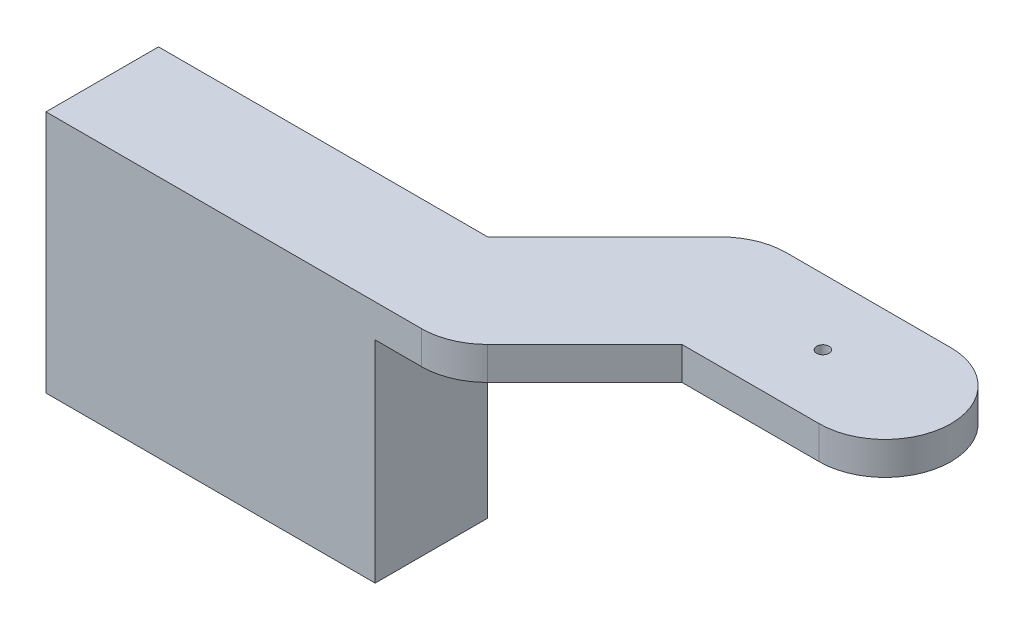
ISO-10303-21;
HEADER;
FILE_DESCRIPTION(('STEP AP214'),'2;1');
FILE_NAME('part.step','',(''),(''),'','','');
FILE_SCHEMA(('AUTOMOTIVE_DESIGN { 1 0 10303 214 1 1 1 1 }'));
ENDSEC;
DATA;
#1=APPLICATION_CONTEXT('core data for automotive mechanical design processes');
#2=APPLICATION_PROTOCOL_DEFINITION('international standard','automotive_design',2000,#1);
#3=PRODUCT_CONTEXT('',#1,'mechanical');
#4=PRODUCT('Part','Part','',(#3));
#5=PRODUCT_RELATED_PRODUCT_CATEGORY('part','',(#4));
#6=PRODUCT_DEFINITION_FORMATION('','',#4);
#7=PRODUCT_DEFINITION_CONTEXT('part definition',#1,'design');
#8=PRODUCT_DEFINITION('design','',#6,#7);
#9=PRODUCT_DEFINITION_SHAPE('','',#8);
#10=(LENGTH_UNIT() NAMED_UNIT(*) SI_UNIT(.MILLI.,.METRE.));
#11=(NAMED_UNIT(*) PLANE_ANGLE_UNIT() SI_UNIT($,.RADIAN.));
#12=(NAMED_UNIT(*) SI_UNIT($,.STERADIAN.) SOLID_ANGLE_UNIT());
#13=UNCERTAINTY_MEASURE_WITH_UNIT(LENGTH_MEASURE(1.E-05),#10,'distance_accuracy_value','');
#14=(GEOMETRIC_REPRESENTATION_CONTEXT(3) GLOBAL_UNCERTAINTY_ASSIGNED_CONTEXT((#13)) GLOBAL_UNIT_ASSIGNED_CONTEXT((#10,
#11,#12)) REPRESENTATION_CONTEXT('',''));
#15=CARTESIAN_POINT('',(0.,0.,0.));
#16=DIRECTION('',(0.,0.,1.));
#17=DIRECTION('',(1.,0.,0.));
#18=AXIS2_PLACEMENT_3D('',#15,#16,#17);
#19=CARTESIAN_POINT('',(0.,-5.,0.));
#20=DIRECTION('',(0.,1.,0.));
#21=DIRECTION('',(0.,0.,1.));
#22=AXIS2_PLACEMENT_3D('',#19,#20,#21);
#23=PLANE('',#22);
#24=DIRECTION('',(0.,0.,1.));
#25=VECTOR('',#24,1.);
#26=CARTESIAN_POINT('',(-37.2487373415292,-5.,27.6966017177983));
#27=LINE('',#26,#25);
#28=CARTESIAN_POINT('',(-37.2487373415292,-5.,10.6066017177983));
#29=VERTEX_POINT('',#28);
#30=CARTESIAN_POINT('',(-37.2487373415292,-5.,27.6966017177983));
#31=VERTEX_POINT('',#30);
#32=EDGE_CURVE('E129',#29,#31,#27,.T.);
#33=ORIENTED_EDGE('',*,*,#32,.F.);
#34=DIRECTION('',(-0.707106781186547,0.,0.707106781186548));
#35=VECTOR('',#34,1.);
#36=CARTESIAN_POINT('',(-13.3210678118655,-5.,-13.3210678118655));
#37=LINE('',#36,#35);
#38=CARTESIAN_POINT('',(-19.5710678118655,-5.,-7.07106781186544));
#39=VERTEX_POINT('',#38);
#40=EDGE_CURVE('E134',#39,#29,#37,.T.);
#41=ORIENTED_EDGE('',*,*,#40,.F.);
#42=CARTESIAN_POINT('',(-12.5,-5.,0.));
#43=DIRECTION('',(0.,1.,0.));
#44=DIRECTION('',(0.,0.,1.));
#45=AXIS2_PLACEMENT_3D('',#42,#43,#44);
#46=CIRCLE('',#45,10.);
#47=CARTESIAN_POINT('',(-12.5,-5.,-10.));
#48=VERTEX_POINT('',#47);
#49=EDGE_CURVE('E164',#48,#39,#46,.T.);
#50=ORIENTED_EDGE('',*,*,#49,.F.);
#51=DIRECTION('',(1.,0.,0.));
#52=VECTOR('',#51,1.);
#53=CARTESIAN_POINT('',(0.,-5.,-10.));
#54=LINE('',#53,#52);
#55=CARTESIAN_POINT('',(12.5,-5.,-10.));
#56=VERTEX_POINT('',#55);
#57=EDGE_CURVE('E186',#48,#56,#54,.T.);
#58=ORIENTED_EDGE('',*,*,#57,.T.);
#59=CARTESIAN_POINT('',(12.5,-5.,0.));
#60=DIRECTION('',(0.,1.,0.));
#61=DIRECTION('',(0.,0.,1.));
#62=AXIS2_PLACEMENT_3D('',#59,#60,#61);
#63=CIRCLE('',#62,10.);
#64=CARTESIAN_POINT('',(12.5,-5.,10.));
#65=VERTEX_POINT('',#64);
#66=EDGE_CURVE('E183',#65,#56,#63,.T.);
#67=ORIENTED_EDGE('',*,*,#66,.F.);
#68=DIRECTION('',(1.,0.,0.));
#69=VECTOR('',#68,1.);
#70=CARTESIAN_POINT('',(0.,-5.,10.));
#71=LINE('',#70,#69);
#72=CARTESIAN_POINT('',(-8.35786437626906,-5.,10.));
#73=VERTEX_POINT('',#72);
#74=EDGE_CURVE('E180',#73,#65,#71,.T.);
#75=ORIENTED_EDGE('',*,*,#74,.F.);
#76=DIRECTION('',(0.707106781186547,0.,-0.707106781186548));
#77=VECTOR('',#76,1.);
#78=CARTESIAN_POINT('',(0.821067811865467,-5.,0.821067811865466));
#79=LINE('',#78,#77);
#80=CARTESIAN_POINT('',(-23.1066017177982,-5.,24.7487373415292));
#81=VERTEX_POINT('',#80);
#82=EDGE_CURVE('E178',#81,#73,#79,.T.);
#83=ORIENTED_EDGE('',*,*,#82,.F.);
#84=CARTESIAN_POINT('',(-30.1965511636339,-5.,17.6966017177982));
#85=DIRECTION('',(0.,1.,0.));
#86=DIRECTION('',(0.,0.,1.));
#87=AXIS2_PLACEMENT_3D('',#84,#85,#86);
#88=CIRCLE('',#87,10.);
#89=CARTESIAN_POINT('',(-30.1965511636339,-5.,27.6966017177982));
#90=VERTEX_POINT('',#89);
#91=EDGE_CURVE('E190',#90,#81,#88,.T.);
#92=ORIENTED_EDGE('',*,*,#91,.F.);
#93=DIRECTION('',(-1.,0.,0.));
#94=VECTOR('',#93,1.);
#95=CARTESIAN_POINT('',(0.,-5.,27.6966017177982));
#96=LINE('',#95,#94);
#97=EDGE_CURVE('E138',#90,#31,#96,.T.);
#98=ORIENTED_EDGE('',*,*,#97,.T.);
#99=EDGE_LOOP('',(#33,#41,#50,#58,#67,#75,#83,#92,#98));
#100=FACE_BOUND('',#99,.T.);
#101=CARTESIAN_POINT('',(-11.,-5.,0.));
#102=DIRECTION('',(0.,1.,0.));
#103=DIRECTION('',(0.,0.,1.));
#104=AXIS2_PLACEMENT_3D('',#101,#102,#103);
#105=CIRCLE('',#104,2.);
#106=CARTESIAN_POINT('',(-11.,-5.,-2.));
#107=VERTEX_POINT('',#106);
#108=CARTESIAN_POINT('',(-11.,-5.,2.));
#109=VERTEX_POINT('',#108);
#110=EDGE_CURVE('E56',#107,#109,#105,.T.);
#111=ORIENTED_EDGE('',*,*,#110,.T.);
#112=DIRECTION('',(0.99849670199507,0.,0.0548118244995303));
#113=VECTOR('',#112,1.);
#114=CARTESIAN_POINT('',(-11.,-5.,2.));
#115=LINE('',#114,#113);
#116=CARTESIAN_POINT('',(0.84092779656255,-5.,2.65));
#117=VERTEX_POINT('',#116);
#118=EDGE_CURVE('E306',#109,#117,#115,.T.);
#119=ORIENTED_EDGE('',*,*,#118,.T.);
#120=CARTESIAN_POINT('',(3.05,-5.,0.));
#121=DIRECTION('',(0.,1.,0.));
#122=DIRECTION('',(0.,0.,1.));
#123=AXIS2_PLACEMENT_3D('',#120,#121,#122);
#124=CIRCLE('',#123,3.45);
#125=CARTESIAN_POINT('',(5.25907220343745,-5.,2.65));
#126=VERTEX_POINT('',#125);
#127=EDGE_CURVE('E303',#117,#126,#124,.T.);
#128=ORIENTED_EDGE('',*,*,#127,.T.);
#129=DIRECTION('',(0.99849670199507,0.,-0.0548118244995303));
#130=VECTOR('',#129,1.);
#131=CARTESIAN_POINT('',(17.1,-5.,2.));
#132=LINE('',#131,#130);
#133=CARTESIAN_POINT('',(17.1,-5.,2.));
#134=VERTEX_POINT('',#133);
#135=EDGE_CURVE('E300',#126,#134,#132,.T.);
#136=ORIENTED_EDGE('',*,*,#135,.T.);
#137=CARTESIAN_POINT('',(17.1,-5.,0.));
#138=DIRECTION('',(0.,1.,0.));
#139=DIRECTION('',(0.,0.,-1.));
#140=AXIS2_PLACEMENT_3D('',#137,#138,#139);
#141=CIRCLE('',#140,2.);
#142=CARTESIAN_POINT('',(17.1,-5.,-2.));
#143=VERTEX_POINT('',#142);
#144=EDGE_CURVE('E297',#134,#143,#141,.T.);
#145=ORIENTED_EDGE('',*,*,#144,.T.);
#146=DIRECTION('',(-0.99849670199507,0.,-0.0548118244995303));
#147=VECTOR('',#146,1.);
#148=CARTESIAN_POINT('',(17.1,-5.,-2.));
#149=LINE('',#148,#147);
#150=CARTESIAN_POINT('',(5.25907220343745,-5.,-2.65));
#151=VERTEX_POINT('',#150);
#152=EDGE_CURVE('E294',#143,#151,#149,.T.);
#153=ORIENTED_EDGE('',*,*,#152,.T.);
#154=CARTESIAN_POINT('',(3.05,-5.,0.));
#155=DIRECTION('',(0.,1.,0.));
#156=DIRECTION('',(0.,0.,1.));
#157=AXIS2_PLACEMENT_3D('',#154,#155,#156);
#158=CIRCLE('',#157,3.45);
#159=CARTESIAN_POINT('',(0.840927796562551,-5.,-2.65));
#160=VERTEX_POINT('',#159);
#161=EDGE_CURVE('E291',#151,#160,#158,.T.);
#162=ORIENTED_EDGE('',*,*,#161,.T.);
#163=DIRECTION('',(-0.99849670199507,0.,0.0548118244995303));
#164=VECTOR('',#163,1.);
#165=CARTESIAN_POINT('',(-11.,-5.,-2.));
#166=LINE('',#165,#164);
#167=EDGE_CURVE('E287',#160,#107,#166,.T.);
#168=ORIENTED_EDGE('',*,*,#167,.T.);
#169=EDGE_LOOP('',(#111,#119,#128,#136,#145,#153,#162,#168));
#170=FACE_BOUND('',#169,.T.);
#171=ADVANCED_FACE('F39',(#100,#170),#23,.F.);
#172=CARTESIAN_POINT('',(0.821067811865467,-5.,0.821067811865466));
#173=DIRECTION('',(0.707106781186548,0.,0.707106781186547));
#174=DIRECTION('',(0.707106781186547,0.,-0.707106781186548));
#175=AXIS2_PLACEMENT_3D('',#172,#173,#174);
#176=PLANE('',#175);
#177=DIRECTION('',(0.707106781186547,0.,-0.707106781186548));
#178=VECTOR('',#177,1.);
#179=CARTESIAN_POINT('',(0.821067811865467,0.,0.821067811865466));
#180=LINE('',#179,#178);
#181=CARTESIAN_POINT('',(-23.1066017177982,0.,24.7487373415292));
#182=VERTEX_POINT('',#181);
#183=CARTESIAN_POINT('',(-8.35786437626906,0.,10.));
#184=VERTEX_POINT('',#183);
#185=EDGE_CURVE('E169',#182,#184,#180,.T.);
#186=ORIENTED_EDGE('',*,*,#185,.F.);
#187=DIRECTION('',(0.,1.,0.));
#188=VECTOR('',#187,1.);
#189=CARTESIAN_POINT('',(-23.1066017177982,-5.,24.7487373415292));
#190=LINE('',#189,#188);
#191=EDGE_CURVE('E11',#81,#182,#190,.T.);
#192=ORIENTED_EDGE('',*,*,#191,.F.);
#193=ORIENTED_EDGE('',*,*,#82,.T.);
#194=DIRECTION('',(0.,1.,0.));
#195=VECTOR('',#194,1.);
#196=CARTESIAN_POINT('',(-8.35786437626906,-5.,10.));
#197=LINE('',#196,#195);
#198=EDGE_CURVE('E108',#73,#184,#197,.T.);
#199=ORIENTED_EDGE('',*,*,#198,.T.);
#200=EDGE_LOOP('',(#186,#192,#193,#199));
#201=FACE_BOUND('',#200,.T.);
#202=ADVANCED_FACE('F41',(#201),#176,.T.);
#203=CARTESIAN_POINT('',(-30.1965511636339,-5.,17.6966017177982));
#204=DIRECTION('',(0.,1.,0.));
#205=DIRECTION('',(0.,0.,1.));
#206=AXIS2_PLACEMENT_3D('',#203,#204,#205);
#207=CYLINDRICAL_SURFACE('',#206,10.);
#208=CARTESIAN_POINT('',(-30.1965511636339,0.,17.6966017177982));
#209=DIRECTION('',(0.,1.,0.));
#210=DIRECTION('',(0.,0.,1.));
#211=AXIS2_PLACEMENT_3D('',#208,#209,#210);
#212=CIRCLE('',#211,10.);
#213=CARTESIAN_POINT('',(-30.1965511636339,0.,27.6966017177982));
#214=VERTEX_POINT('',#213);
#215=EDGE_CURVE('E181',#214,#182,#212,.T.);
#216=ORIENTED_EDGE('',*,*,#215,.F.);
#217=DIRECTION('',(0.,1.,0.));
#218=VECTOR('',#217,1.);
#219=CARTESIAN_POINT('',(-30.1965511636339,-5.,27.6966017177982));
#220=LINE('',#219,#218);
#221=EDGE_CURVE('E48',#90,#214,#220,.T.);
#222=ORIENTED_EDGE('',*,*,#221,.F.);
#223=ORIENTED_EDGE('',*,*,#91,.T.);
#224=ORIENTED_EDGE('',*,*,#191,.T.);
#225=EDGE_LOOP('',(#216,#222,#223,#224));
#226=FACE_BOUND('',#225,.T.);
#227=ADVANCED_FACE('F229',(#226),#207,.T.);
#228=CARTESIAN_POINT('',(0.,-5.,27.6966017177982));
#229=DIRECTION('',(0.,0.,-1.));
#230=DIRECTION('',(-1.,0.,0.));
#231=AXIS2_PLACEMENT_3D('',#228,#229,#230);
#232=PLANE('',#231);
#233=DIRECTION('',(-1.,0.,0.));
#234=VECTOR('',#233,1.);
#235=CARTESIAN_POINT('',(0.,0.,27.6966017177982));
#236=LINE('',#235,#234);
#237=CARTESIAN_POINT('',(-87.2487373415292,0.,27.6966017177983));
#238=VERTEX_POINT('',#237);
#239=EDGE_CURVE('E209',#214,#238,#236,.T.);
#240=ORIENTED_EDGE('',*,*,#239,.T.);
#241=DIRECTION('',(0.,1.,0.));
#242=VECTOR('',#241,1.);
#243=CARTESIAN_POINT('',(-87.2487373415292,-5.,27.6966017177983));
#244=LINE('',#243,#242);
#245=CARTESIAN_POINT('',(-87.2487373415292,-37.,27.6966017177983));
#246=VERTEX_POINT('',#245);
#247=EDGE_CURVE('E215',#246,#238,#244,.T.);
#248=ORIENTED_EDGE('',*,*,#247,.F.);
#249=DIRECTION('',(-1.,0.,0.));
#250=VECTOR('',#249,1.);
#251=CARTESIAN_POINT('',(-87.2487373415292,-37.,27.6966017177983));
#252=LINE('',#251,#250);
#253=CARTESIAN_POINT('',(-37.2487373415292,-37.,27.6966017177983));
#254=VERTEX_POINT('',#253);
#255=EDGE_CURVE('E175',#254,#246,#252,.T.);
#256=ORIENTED_EDGE('',*,*,#255,.F.);
#257=DIRECTION('',(0.,1.,0.));
#258=VECTOR('',#257,1.);
#259=CARTESIAN_POINT('',(-37.2487373415292,-37.,27.6966017177983));
#260=LINE('',#259,#258);
#261=EDGE_CURVE('E170',#254,#31,#260,.T.);
#262=ORIENTED_EDGE('',*,*,#261,.T.);
#263=ORIENTED_EDGE('',*,*,#97,.F.);
#264=ORIENTED_EDGE('',*,*,#221,.T.);
#265=EDGE_LOOP('',(#240,#248,#256,#262,#263,#264));
#266=FACE_BOUND('',#265,.T.);
#267=ADVANCED_FACE('F231',(#266),#232,.F.);
#268=CARTESIAN_POINT('',(-87.2487373415292,-5.,0.));
#269=DIRECTION('',(-1.,0.,0.));
#270=DIRECTION('',(0.,0.,1.));
#271=AXIS2_PLACEMENT_3D('',#268,#269,#270);
#272=PLANE('',#271);
#273=DIRECTION('',(0.,0.,1.));
#274=VECTOR('',#273,1.);
#275=CARTESIAN_POINT('',(-87.2487373415292,0.,0.));
#276=LINE('',#275,#274);
#277=CARTESIAN_POINT('',(-87.2487373415292,0.,10.6066017177983));
#278=VERTEX_POINT('',#277);
#279=EDGE_CURVE('E206',#278,#238,#276,.T.);
#280=ORIENTED_EDGE('',*,*,#279,.F.);
#281=DIRECTION('',(0.,1.,0.));
#282=VECTOR('',#281,1.);
#283=CARTESIAN_POINT('',(-87.2487373415292,-5.,10.6066017177983));
#284=LINE('',#283,#282);
#285=CARTESIAN_POINT('',(-87.2487373415292,-37.,10.6066017177983));
#286=VERTEX_POINT('',#285);
#287=EDGE_CURVE('E160',#286,#278,#284,.T.);
#288=ORIENTED_EDGE('',*,*,#287,.F.);
#289=DIRECTION('',(0.,0.,-1.));
#290=VECTOR('',#289,1.);
#291=CARTESIAN_POINT('',(-87.2487373415292,-37.,27.6966017177983));
#292=LINE('',#291,#290);
#293=EDGE_CURVE('E143',#246,#286,#292,.T.);
#294=ORIENTED_EDGE('',*,*,#293,.F.);
#295=ORIENTED_EDGE('',*,*,#247,.T.);
#296=EDGE_LOOP('',(#280,#288,#294,#295));
#297=FACE_BOUND('',#296,.T.);
#298=ADVANCED_FACE('F246',(#297),#272,.T.);
#299=CARTESIAN_POINT('',(0.,-5.,10.6066017177982));
#300=DIRECTION('',(0.,0.,1.));
#301=DIRECTION('',(1.,0.,0.));
#302=AXIS2_PLACEMENT_3D('',#299,#300,#301);
#303=PLANE('',#302);
#304=DIRECTION('',(1.,0.,0.));
#305=VECTOR('',#304,1.);
#306=CARTESIAN_POINT('',(0.,0.,10.6066017177982));
#307=LINE('',#306,#305);
#308=CARTESIAN_POINT('',(-37.2487373415292,0.,10.6066017177983));
#309=VERTEX_POINT('',#308);
#310=EDGE_CURVE('E156',#278,#309,#307,.T.);
#311=ORIENTED_EDGE('',*,*,#310,.T.);
#312=DIRECTION('',(0.,1.,0.));
#313=VECTOR('',#312,1.);
#314=CARTESIAN_POINT('',(-37.2487373415292,-5.,10.6066017177983));
#315=LINE('',#314,#313);
#316=EDGE_CURVE('E149',#29,#309,#315,.T.);
#317=ORIENTED_EDGE('',*,*,#316,.F.);
#318=DIRECTION('',(0.,1.,0.));
#319=VECTOR('',#318,1.);
#320=CARTESIAN_POINT('',(-37.2487373415292,-37.,10.6066017177983));
#321=LINE('',#320,#319);
#322=CARTESIAN_POINT('',(-37.2487373415292,-37.,10.6066017177983));
#323=VERTEX_POINT('',#322);
#324=EDGE_CURVE('E153',#323,#29,#321,.T.);
#325=ORIENTED_EDGE('',*,*,#324,.F.);
#326=DIRECTION('',(1.,0.,0.));
#327=VECTOR('',#326,1.);
#328=CARTESIAN_POINT('',(-87.2487373415292,-37.,10.6066017177983));
#329=LINE('',#328,#327);
#330=EDGE_CURVE('E257',#286,#323,#329,.T.);
#331=ORIENTED_EDGE('',*,*,#330,.F.);
#332=ORIENTED_EDGE('',*,*,#287,.T.);
#333=EDGE_LOOP('',(#311,#317,#325,#331,#332));
#334=FACE_BOUND('',#333,.T.);
#335=ADVANCED_FACE('F150',(#334),#303,.F.);
#336=CARTESIAN_POINT('',(-13.3210678118655,-5.,-13.3210678118655));
#337=DIRECTION('',(-0.707106781186548,0.,-0.707106781186547));
#338=DIRECTION('',(-0.707106781186547,0.,0.707106781186548));
#339=AXIS2_PLACEMENT_3D('',#336,#337,#338);
#340=PLANE('',#339);
#341=DIRECTION('',(-0.707106781186547,0.,0.707106781186548));
#342=VECTOR('',#341,1.);
#343=CARTESIAN_POINT('',(-13.3210678118655,0.,-13.3210678118655));
#344=LINE('',#343,#342);
#345=CARTESIAN_POINT('',(-19.5710678118655,0.,-7.07106781186544));
#346=VERTEX_POINT('',#345);
#347=EDGE_CURVE('E203',#346,#309,#344,.T.);
#348=ORIENTED_EDGE('',*,*,#347,.F.);
#349=DIRECTION('',(0.,1.,0.));
#350=VECTOR('',#349,1.);
#351=CARTESIAN_POINT('',(-19.5710678118655,-5.,-7.07106781186544));
#352=LINE('',#351,#350);
#353=EDGE_CURVE('E161',#39,#346,#352,.T.);
#354=ORIENTED_EDGE('',*,*,#353,.F.);
#355=ORIENTED_EDGE('',*,*,#40,.T.);
#356=ORIENTED_EDGE('',*,*,#316,.T.);
#357=EDGE_LOOP('',(#348,#354,#355,#356));
#358=FACE_BOUND('',#357,.T.);
#359=ADVANCED_FACE('F163',(#358),#340,.T.);
#360=CARTESIAN_POINT('',(-12.5,-5.,0.));
#361=DIRECTION('',(0.,1.,0.));
#362=DIRECTION('',(0.,0.,1.));
#363=AXIS2_PLACEMENT_3D('',#360,#361,#362);
#364=CYLINDRICAL_SURFACE('',#363,10.);
#365=CARTESIAN_POINT('',(-12.5,0.,0.));
#366=DIRECTION('',(0.,1.,0.));
#367=DIRECTION('',(0.,0.,1.));
#368=AXIS2_PLACEMENT_3D('',#365,#366,#367);
#369=CIRCLE('',#368,10.);
#370=CARTESIAN_POINT('',(-12.5,0.,-10.));
#371=VERTEX_POINT('',#370);
#372=EDGE_CURVE('E200',#371,#346,#369,.T.);
#373=ORIENTED_EDGE('',*,*,#372,.F.);
#374=DIRECTION('',(0.,1.,0.));
#375=VECTOR('',#374,1.);
#376=CARTESIAN_POINT('',(-12.5,-5.,-10.));
#377=LINE('',#376,#375);
#378=EDGE_CURVE('E219',#48,#371,#377,.T.);
#379=ORIENTED_EDGE('',*,*,#378,.F.);
#380=ORIENTED_EDGE('',*,*,#49,.T.);
#381=ORIENTED_EDGE('',*,*,#353,.T.);
#382=EDGE_LOOP('',(#373,#379,#380,#381));
#383=FACE_BOUND('',#382,.T.);
#384=ADVANCED_FACE('F242',(#383),#364,.T.);
#385=CARTESIAN_POINT('',(0.,-5.,-10.));
#386=DIRECTION('',(0.,0.,1.));
#387=DIRECTION('',(1.,0.,0.));
#388=AXIS2_PLACEMENT_3D('',#385,#386,#387);
#389=PLANE('',#388);
#390=DIRECTION('',(1.,0.,0.));
#391=VECTOR('',#390,1.);
#392=CARTESIAN_POINT('',(0.,0.,-10.));
#393=LINE('',#392,#391);
#394=CARTESIAN_POINT('',(12.5,0.,-10.));
#395=VERTEX_POINT('',#394);
#396=EDGE_CURVE('E197',#371,#395,#393,.T.);
#397=ORIENTED_EDGE('',*,*,#396,.T.);
#398=DIRECTION('',(0.,1.,0.));
#399=VECTOR('',#398,1.);
#400=CARTESIAN_POINT('',(12.5,-5.,-10.));
#401=LINE('',#400,#399);
#402=EDGE_CURVE('E221',#56,#395,#401,.T.);
#403=ORIENTED_EDGE('',*,*,#402,.F.);
#404=ORIENTED_EDGE('',*,*,#57,.F.);
#405=ORIENTED_EDGE('',*,*,#378,.T.);
#406=EDGE_LOOP('',(#397,#403,#404,#405));
#407=FACE_BOUND('',#406,.T.);
#408=ADVANCED_FACE('F434',(#407),#389,.F.);
#409=CARTESIAN_POINT('',(12.5,-5.,0.));
#410=DIRECTION('',(0.,1.,0.));
#411=DIRECTION('',(0.,0.,1.));
#412=AXIS2_PLACEMENT_3D('',#409,#410,#411);
#413=CYLINDRICAL_SURFACE('',#412,10.);
#414=CARTESIAN_POINT('',(12.5,0.,0.));
#415=DIRECTION('',(0.,1.,0.));
#416=DIRECTION('',(0.,0.,1.));
#417=AXIS2_PLACEMENT_3D('',#414,#415,#416);
#418=CIRCLE('',#417,10.);
#419=CARTESIAN_POINT('',(12.5,0.,10.));
#420=VERTEX_POINT('',#419);
#421=EDGE_CURVE('E194',#420,#395,#418,.T.);
#422=ORIENTED_EDGE('',*,*,#421,.F.);
#423=DIRECTION('',(0.,1.,0.));
#424=VECTOR('',#423,1.);
#425=CARTESIAN_POINT('',(12.5,-5.,10.));
#426=LINE('',#425,#424);
#427=EDGE_CURVE('E223',#65,#420,#426,.T.);
#428=ORIENTED_EDGE('',*,*,#427,.F.);
#429=ORIENTED_EDGE('',*,*,#66,.T.);
#430=ORIENTED_EDGE('',*,*,#402,.T.);
#431=EDGE_LOOP('',(#422,#428,#429,#430));
#432=FACE_BOUND('',#431,.T.);
#433=ADVANCED_FACE('F237',(#432),#413,.T.);
#434=CARTESIAN_POINT('',(0.,-5.,10.));
#435=DIRECTION('',(0.,0.,1.));
#436=DIRECTION('',(1.,0.,0.));
#437=AXIS2_PLACEMENT_3D('',#434,#435,#436);
#438=PLANE('',#437);
#439=DIRECTION('',(1.,0.,0.));
#440=VECTOR('',#439,1.);
#441=CARTESIAN_POINT('',(0.,0.,10.));
#442=LINE('',#441,#440);
#443=EDGE_CURVE('E173',#184,#420,#442,.T.);
#444=ORIENTED_EDGE('',*,*,#443,.F.);
#445=ORIENTED_EDGE('',*,*,#198,.F.);
#446=ORIENTED_EDGE('',*,*,#74,.T.);
#447=ORIENTED_EDGE('',*,*,#427,.T.);
#448=EDGE_LOOP('',(#444,#445,#446,#447));
#449=FACE_BOUND('',#448,.T.);
#450=ADVANCED_FACE('F224',(#449),#438,.T.);
#451=CARTESIAN_POINT('',(0.,0.,0.));
#452=DIRECTION('',(0.,1.,0.));
#453=DIRECTION('',(0.,0.,1.));
#454=AXIS2_PLACEMENT_3D('',#451,#452,#453);
#455=PLANE('',#454);
#456=CARTESIAN_POINT('',(3.05,0.,0.));
#457=DIRECTION('',(0.,1.,0.));
#458=DIRECTION('',(0.,0.,1.));
#459=AXIS2_PLACEMENT_3D('',#456,#457,#458);
#460=CIRCLE('',#459,0.94);
#461=CARTESIAN_POINT('',(3.05,0.,0.939999999999999));
#462=VERTEX_POINT('',#461);
#463=EDGE_CURVE('E144',#462,#462,#460,.T.);
#464=ORIENTED_EDGE('',*,*,#463,.F.);
#465=EDGE_LOOP('',(#464));
#466=FACE_BOUND('',#465,.T.);
#467=ORIENTED_EDGE('',*,*,#185,.T.);
#468=ORIENTED_EDGE('',*,*,#443,.T.);
#469=ORIENTED_EDGE('',*,*,#421,.T.);
#470=ORIENTED_EDGE('',*,*,#396,.F.);
#471=ORIENTED_EDGE('',*,*,#372,.T.);
#472=ORIENTED_EDGE('',*,*,#347,.T.);
#473=ORIENTED_EDGE('',*,*,#310,.F.);
#474=ORIENTED_EDGE('',*,*,#279,.T.);
#475=ORIENTED_EDGE('',*,*,#239,.F.);
#476=ORIENTED_EDGE('',*,*,#215,.T.);
#477=EDGE_LOOP('',(#467,#468,#469,#470,#471,#472,#473,#474,#475,#476));
#478=FACE_BOUND('',#477,.T.);
#479=ADVANCED_FACE('F227',(#466,#478),#455,.T.);
#480=CARTESIAN_POINT('',(-37.2487373415292,-37.,27.6966017177983));
#481=DIRECTION('',(-1.,0.,0.));
#482=DIRECTION('',(0.,0.,1.));
#483=AXIS2_PLACEMENT_3D('',#480,#481,#482);
#484=PLANE('',#483);
#485=ORIENTED_EDGE('',*,*,#32,.T.);
#486=ORIENTED_EDGE('',*,*,#261,.F.);
#487=DIRECTION('',(0.,0.,1.));
#488=VECTOR('',#487,1.);
#489=CARTESIAN_POINT('',(-37.2487373415292,-37.,27.6966017177983));
#490=LINE('',#489,#488);
#491=EDGE_CURVE('E168',#323,#254,#490,.T.);
#492=ORIENTED_EDGE('',*,*,#491,.F.);
#493=ORIENTED_EDGE('',*,*,#324,.T.);
#494=EDGE_LOOP('',(#485,#486,#492,#493));
#495=FACE_BOUND('',#494,.T.);
#496=ADVANCED_FACE('F166',(#495),#484,.F.);
#497=CARTESIAN_POINT('',(0.,-37.,0.));
#498=DIRECTION('',(0.,-1.,0.));
#499=DIRECTION('',(0.,0.,-1.));
#500=AXIS2_PLACEMENT_3D('',#497,#498,#499);
#501=PLANE('',#500);
#502=ORIENTED_EDGE('',*,*,#293,.T.);
#503=ORIENTED_EDGE('',*,*,#330,.T.);
#504=ORIENTED_EDGE('',*,*,#491,.T.);
#505=ORIENTED_EDGE('',*,*,#255,.T.);
#506=EDGE_LOOP('',(#502,#503,#504,#505));
#507=FACE_BOUND('',#506,.T.);
#508=ADVANCED_FACE('F254',(#507),#501,.T.);
#509=CARTESIAN_POINT('',(3.05,-37.,0.));
#510=DIRECTION('',(0.,1.,0.));
#511=DIRECTION('',(0.,0.,1.));
#512=AXIS2_PLACEMENT_3D('',#509,#510,#511);
#513=CYLINDRICAL_SURFACE('',#512,0.94);
#514=CARTESIAN_POINT('',(3.05,-3.,0.));
#515=DIRECTION('',(0.,1.,0.));
#516=DIRECTION('',(0.,0.,1.));
#517=AXIS2_PLACEMENT_3D('',#514,#515,#516);
#518=CIRCLE('',#517,0.94);
#519=CARTESIAN_POINT('',(3.05,-3.,0.939999999999999));
#520=VERTEX_POINT('',#519);
#521=EDGE_CURVE('E43',#520,#520,#518,.F.);
#522=ORIENTED_EDGE('',*,*,#521,.T.);
#523=EDGE_LOOP('',(#522));
#524=FACE_BOUND('',#523,.T.);
#525=ORIENTED_EDGE('',*,*,#463,.T.);
#526=EDGE_LOOP('',(#525));
#527=FACE_BOUND('',#526,.T.);
#528=ADVANCED_FACE('F460',(#524,#527),#513,.F.);
#529=CARTESIAN_POINT('',(-11.,-3.,0.));
#530=DIRECTION('',(0.,1.,0.));
#531=DIRECTION('',(0.,0.,1.));
#532=AXIS2_PLACEMENT_3D('',#529,#530,#531);
#533=PLANE('',#532);
#534=CARTESIAN_POINT('',(-11.,-3.,0.));
#535=DIRECTION('',(0.,1.,0.));
#536=DIRECTION('',(0.,0.,1.));
#537=AXIS2_PLACEMENT_3D('',#534,#535,#536);
#538=CIRCLE('',#537,2.);
#539=CARTESIAN_POINT('',(-11.,-3.,-2.));
#540=VERTEX_POINT('',#539);
#541=CARTESIAN_POINT('',(-11.,-3.,2.));
#542=VERTEX_POINT('',#541);
#543=EDGE_CURVE('E290',#540,#542,#538,.T.);
#544=ORIENTED_EDGE('',*,*,#543,.F.);
#545=DIRECTION('',(-0.99849670199507,0.,0.0548118244995303));
#546=VECTOR('',#545,1.);
#547=CARTESIAN_POINT('',(-11.,-3.,-2.));
#548=LINE('',#547,#546);
#549=CARTESIAN_POINT('',(0.840927796562551,-3.,-2.65));
#550=VERTEX_POINT('',#549);
#551=EDGE_CURVE('E286',#550,#540,#548,.T.);
#552=ORIENTED_EDGE('',*,*,#551,.F.);
#553=CARTESIAN_POINT('',(3.05,-3.,0.));
#554=DIRECTION('',(0.,1.,0.));
#555=DIRECTION('',(0.,0.,1.));
#556=AXIS2_PLACEMENT_3D('',#553,#554,#555);
#557=CIRCLE('',#556,3.45);
#558=CARTESIAN_POINT('',(5.25907220343745,-3.,-2.65));
#559=VERTEX_POINT('',#558);
#560=EDGE_CURVE('E312',#559,#550,#557,.T.);
#561=ORIENTED_EDGE('',*,*,#560,.F.);
#562=DIRECTION('',(-0.99849670199507,0.,-0.0548118244995303));
#563=VECTOR('',#562,1.);
#564=CARTESIAN_POINT('',(17.1,-3.,-2.));
#565=LINE('',#564,#563);
#566=CARTESIAN_POINT('',(17.1,-3.,-2.));
#567=VERTEX_POINT('',#566);
#568=EDGE_CURVE('E315',#567,#559,#565,.T.);
#569=ORIENTED_EDGE('',*,*,#568,.F.);
#570=CARTESIAN_POINT('',(17.1,-3.,0.));
#571=DIRECTION('',(0.,1.,0.));
#572=DIRECTION('',(0.,0.,-1.));
#573=AXIS2_PLACEMENT_3D('',#570,#571,#572);
#574=CIRCLE('',#573,2.);
#575=CARTESIAN_POINT('',(17.1,-3.,2.));
#576=VERTEX_POINT('',#575);
#577=EDGE_CURVE('E318',#576,#567,#574,.T.);
#578=ORIENTED_EDGE('',*,*,#577,.F.);
#579=DIRECTION('',(0.99849670199507,0.,-0.0548118244995303));
#580=VECTOR('',#579,1.);
#581=CARTESIAN_POINT('',(17.1,-3.,2.));
#582=LINE('',#581,#580);
#583=CARTESIAN_POINT('',(5.25907220343745,-3.,2.65));
#584=VERTEX_POINT('',#583);
#585=EDGE_CURVE('E321',#584,#576,#582,.T.);
#586=ORIENTED_EDGE('',*,*,#585,.F.);
#587=CARTESIAN_POINT('',(3.05,-3.,0.));
#588=DIRECTION('',(0.,1.,0.));
#589=DIRECTION('',(0.,0.,1.));
#590=AXIS2_PLACEMENT_3D('',#587,#588,#589);
#591=CIRCLE('',#590,3.45);
#592=CARTESIAN_POINT('',(0.84092779656255,-3.,2.65));
#593=VERTEX_POINT('',#592);
#594=EDGE_CURVE('E324',#593,#584,#591,.T.);
#595=ORIENTED_EDGE('',*,*,#594,.F.);
#596=DIRECTION('',(0.99849670199507,0.,0.0548118244995303));
#597=VECTOR('',#596,1.);
#598=CARTESIAN_POINT('',(-11.,-3.,2.));
#599=LINE('',#598,#597);
#600=EDGE_CURVE('E327',#542,#593,#599,.T.);
#601=ORIENTED_EDGE('',*,*,#600,.F.);
#602=EDGE_LOOP('',(#544,#552,#561,#569,#578,#586,#595,#601));
#603=FACE_BOUND('',#602,.T.);
#604=ORIENTED_EDGE('',*,*,#521,.F.);
#605=EDGE_LOOP('',(#604));
#606=FACE_BOUND('',#605,.T.);
#607=ADVANCED_FACE('F387',(#603,#606),#533,.F.);
#608=CARTESIAN_POINT('',(-11.,-3.,0.));
#609=DIRECTION('',(0.,-1.,0.));
#610=DIRECTION('',(0.,0.,-1.));
#611=AXIS2_PLACEMENT_3D('',#608,#609,#610);
#612=CYLINDRICAL_SURFACE('',#611,2.);
#613=ORIENTED_EDGE('',*,*,#110,.F.);
#614=DIRECTION('',(0.,-1.,0.));
#615=VECTOR('',#614,1.);
#616=CARTESIAN_POINT('',(-11.,-3.,-2.));
#617=LINE('',#616,#615);
#618=EDGE_CURVE('E284',#540,#107,#617,.T.);
#619=ORIENTED_EDGE('',*,*,#618,.F.);
#620=ORIENTED_EDGE('',*,*,#543,.T.);
#621=DIRECTION('',(0.,-1.,0.));
#622=VECTOR('',#621,1.);
#623=CARTESIAN_POINT('',(-11.,-3.,2.));
#624=LINE('',#623,#622);
#625=EDGE_CURVE('E264',#542,#109,#624,.T.);
#626=ORIENTED_EDGE('',*,*,#625,.T.);
#627=EDGE_LOOP('',(#613,#619,#620,#626));
#628=FACE_BOUND('',#627,.T.);
#629=ADVANCED_FACE('F334',(#628),#612,.F.);
#630=CARTESIAN_POINT('',(-11.,-3.,2.));
#631=DIRECTION('',(0.0548118244995303,0.,-0.998496701995071));
#632=DIRECTION('',(-0.998496701995071,0.,-0.0548118244995303));
#633=AXIS2_PLACEMENT_3D('',#630,#631,#632);
#634=PLANE('',#633);
#635=ORIENTED_EDGE('',*,*,#118,.F.);
#636=ORIENTED_EDGE('',*,*,#625,.F.);
#637=ORIENTED_EDGE('',*,*,#600,.T.);
#638=DIRECTION('',(0.,-1.,0.));
#639=VECTOR('',#638,1.);
#640=CARTESIAN_POINT('',(0.84092779656255,-3.,2.65));
#641=LINE('',#640,#639);
#642=EDGE_CURVE('E266',#593,#117,#641,.T.);
#643=ORIENTED_EDGE('',*,*,#642,.T.);
#644=EDGE_LOOP('',(#635,#636,#637,#643));
#645=FACE_BOUND('',#644,.T.);
#646=ADVANCED_FACE('F345',(#645),#634,.T.);
#647=CARTESIAN_POINT('',(3.05,-3.,0.));
#648=DIRECTION('',(0.,-1.,0.));
#649=DIRECTION('',(0.,0.,-1.));
#650=AXIS2_PLACEMENT_3D('',#647,#648,#649);
#651=CYLINDRICAL_SURFACE('',#650,3.45);
#652=ORIENTED_EDGE('',*,*,#127,.F.);
#653=ORIENTED_EDGE('',*,*,#642,.F.);
#654=ORIENTED_EDGE('',*,*,#594,.T.);
#655=DIRECTION('',(0.,-1.,0.));
#656=VECTOR('',#655,1.);
#657=CARTESIAN_POINT('',(5.25907220343745,-3.,2.65));
#658=LINE('',#657,#656);
#659=EDGE_CURVE('E269',#584,#126,#658,.T.);
#660=ORIENTED_EDGE('',*,*,#659,.T.);
#661=EDGE_LOOP('',(#652,#653,#654,#660));
#662=FACE_BOUND('',#661,.T.);
#663=ADVANCED_FACE('F380',(#662),#651,.F.);
#664=CARTESIAN_POINT('',(17.1,-3.,2.));
#665=DIRECTION('',(-0.0548118244995303,0.,-0.998496701995071));
#666=DIRECTION('',(-0.998496701995071,0.,0.0548118244995303));
#667=AXIS2_PLACEMENT_3D('',#664,#665,#666);
#668=PLANE('',#667);
#669=ORIENTED_EDGE('',*,*,#135,.F.);
#670=ORIENTED_EDGE('',*,*,#659,.F.);
#671=ORIENTED_EDGE('',*,*,#585,.T.);
#672=DIRECTION('',(0.,-1.,0.));
#673=VECTOR('',#672,1.);
#674=CARTESIAN_POINT('',(17.1,-3.,2.));
#675=LINE('',#674,#673);
#676=EDGE_CURVE('E272',#576,#134,#675,.T.);
#677=ORIENTED_EDGE('',*,*,#676,.T.);
#678=EDGE_LOOP('',(#669,#670,#671,#677));
#679=FACE_BOUND('',#678,.T.);
#680=ADVANCED_FACE('F384',(#679),#668,.T.);
#681=CARTESIAN_POINT('',(17.1,-3.,0.));
#682=DIRECTION('',(0.,-1.,0.));
#683=DIRECTION('',(0.,0.,-1.));
#684=AXIS2_PLACEMENT_3D('',#681,#682,#683);
#685=CYLINDRICAL_SURFACE('',#684,2.);
#686=ORIENTED_EDGE('',*,*,#144,.F.);
#687=ORIENTED_EDGE('',*,*,#676,.F.);
#688=ORIENTED_EDGE('',*,*,#577,.T.);
#689=DIRECTION('',(0.,-1.,0.));
#690=VECTOR('',#689,1.);
#691=CARTESIAN_POINT('',(17.1,-3.,-2.));
#692=LINE('',#691,#690);
#693=EDGE_CURVE('E275',#567,#143,#692,.T.);
#694=ORIENTED_EDGE('',*,*,#693,.T.);
#695=EDGE_LOOP('',(#686,#687,#688,#694));
#696=FACE_BOUND('',#695,.T.);
#697=ADVANCED_FACE('F394',(#696),#685,.F.);
#698=CARTESIAN_POINT('',(17.1,-3.,-2.));
#699=DIRECTION('',(-0.0548118244995303,0.,0.998496701995071));
#700=DIRECTION('',(0.998496701995071,0.,0.0548118244995303));
#701=AXIS2_PLACEMENT_3D('',#698,#699,#700);
#702=PLANE('',#701);
#703=ORIENTED_EDGE('',*,*,#152,.F.);
#704=ORIENTED_EDGE('',*,*,#693,.F.);
#705=ORIENTED_EDGE('',*,*,#568,.T.);
#706=DIRECTION('',(0.,-1.,0.));
#707=VECTOR('',#706,1.);
#708=CARTESIAN_POINT('',(5.25907220343745,-3.,-2.65));
#709=LINE('',#708,#707);
#710=EDGE_CURVE('E278',#559,#151,#709,.T.);
#711=ORIENTED_EDGE('',*,*,#710,.T.);
#712=EDGE_LOOP('',(#703,#704,#705,#711));
#713=FACE_BOUND('',#712,.T.);
#714=ADVANCED_FACE('F397',(#713),#702,.T.);
#715=CARTESIAN_POINT('',(3.05,-3.,0.));
#716=DIRECTION('',(0.,-1.,0.));
#717=DIRECTION('',(0.,0.,-1.));
#718=AXIS2_PLACEMENT_3D('',#715,#716,#717);
#719=CYLINDRICAL_SURFACE('',#718,3.45);
#720=ORIENTED_EDGE('',*,*,#161,.F.);
#721=ORIENTED_EDGE('',*,*,#710,.F.);
#722=ORIENTED_EDGE('',*,*,#560,.T.);
#723=DIRECTION('',(0.,-1.,0.));
#724=VECTOR('',#723,1.);
#725=CARTESIAN_POINT('',(0.840927796562551,-3.,-2.65));
#726=LINE('',#725,#724);
#727=EDGE_CURVE('E281',#550,#160,#726,.T.);
#728=ORIENTED_EDGE('',*,*,#727,.T.);
#729=EDGE_LOOP('',(#720,#721,#722,#728));
#730=FACE_BOUND('',#729,.T.);
#731=ADVANCED_FACE('F402',(#730),#719,.F.);
#732=CARTESIAN_POINT('',(-11.,-3.,-2.));
#733=DIRECTION('',(0.0548118244995303,0.,0.998496701995071));
#734=DIRECTION('',(0.998496701995071,0.,-0.0548118244995303));
#735=AXIS2_PLACEMENT_3D('',#732,#733,#734);
#736=PLANE('',#735);
#737=ORIENTED_EDGE('',*,*,#167,.F.);
#738=ORIENTED_EDGE('',*,*,#727,.F.);
#739=ORIENTED_EDGE('',*,*,#551,.T.);
#740=ORIENTED_EDGE('',*,*,#618,.T.);
#741=EDGE_LOOP('',(#737,#738,#739,#740));
#742=FACE_BOUND('',#741,.T.);
#743=ADVANCED_FACE('F403',(#742),#736,.T.);
#744=CLOSED_SHELL('',(#171,#202,#227,#267,#298,#335,#359,#384,#408,#433,#450,#479,#496,#508,
#528,#607,#629,#646,#663,#680,#697,#714,#731,#743));
#745=MANIFOLD_SOLID_BREP('B2',#744);
#746=ADVANCED_BREP_SHAPE_REPRESENTATION('',(#18,#745),#14);
#747=SHAPE_DEFINITION_REPRESENTATION(#9,#746);
ENDSEC;
END-ISO-10303-21;
